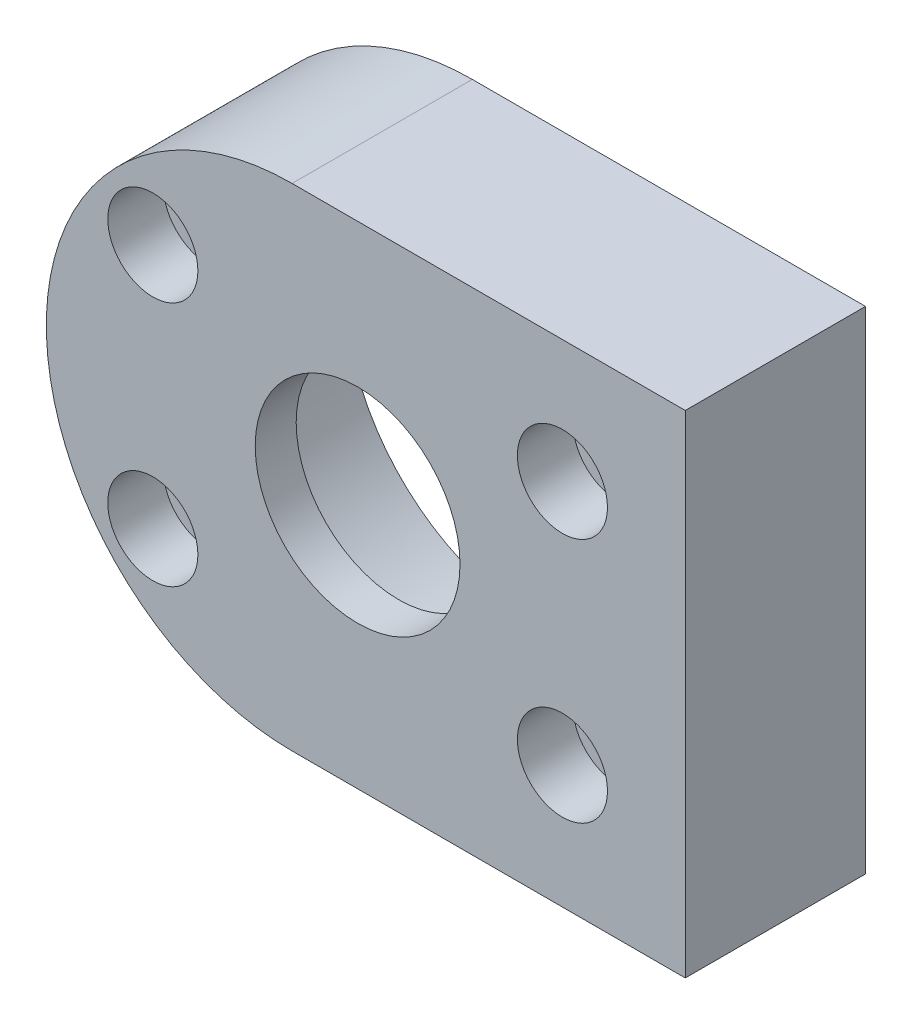
ISO-10303-21;
HEADER;
FILE_DESCRIPTION(('STEP AP214'),'2;1');
FILE_NAME('part.step','',(''),(''),'','','');
FILE_SCHEMA(('AUTOMOTIVE_DESIGN { 1 0 10303 214 1 1 1 1 }'));
ENDSEC;
DATA;
#1=APPLICATION_CONTEXT('core data for automotive mechanical design processes');
#2=APPLICATION_PROTOCOL_DEFINITION('international standard','automotive_design',2000,#1);
#3=PRODUCT_CONTEXT('',#1,'mechanical');
#4=PRODUCT('Part','Part','',(#3));
#5=PRODUCT_RELATED_PRODUCT_CATEGORY('part','',(#4));
#6=PRODUCT_DEFINITION_FORMATION('','',#4);
#7=PRODUCT_DEFINITION_CONTEXT('part definition',#1,'design');
#8=PRODUCT_DEFINITION('design','',#6,#7);
#9=PRODUCT_DEFINITION_SHAPE('','',#8);
#10=(LENGTH_UNIT() NAMED_UNIT(*) SI_UNIT(.MILLI.,.METRE.));
#11=(NAMED_UNIT(*) PLANE_ANGLE_UNIT() SI_UNIT($,.RADIAN.));
#12=(NAMED_UNIT(*) SI_UNIT($,.STERADIAN.) SOLID_ANGLE_UNIT());
#13=UNCERTAINTY_MEASURE_WITH_UNIT(LENGTH_MEASURE(1.E-05),#10,'distance_accuracy_value','');
#14=(GEOMETRIC_REPRESENTATION_CONTEXT(3) GLOBAL_UNCERTAINTY_ASSIGNED_CONTEXT((#13)) GLOBAL_UNIT_ASSIGNED_CONTEXT((#10,
#11,#12)) REPRESENTATION_CONTEXT('',''));
#15=CARTESIAN_POINT('',(0.,0.,0.));
#16=DIRECTION('',(0.,0.,1.));
#17=DIRECTION('',(1.,0.,0.));
#18=AXIS2_PLACEMENT_3D('',#15,#16,#17);
#19=CARTESIAN_POINT('',(0.,0.,22.));
#20=DIRECTION('',(0.,0.,-1.));
#21=DIRECTION('',(-1.,0.,0.));
#22=AXIS2_PLACEMENT_3D('',#19,#20,#21);
#23=CYLINDRICAL_SURFACE('',#22,12.5);
#24=CARTESIAN_POINT('',(0.,0.,22.));
#25=DIRECTION('',(0.,0.,1.));
#26=DIRECTION('',(1.,0.,0.));
#27=AXIS2_PLACEMENT_3D('',#24,#25,#26);
#28=CIRCLE('',#27,12.5);
#29=CARTESIAN_POINT('',(12.5,0.,22.));
#30=VERTEX_POINT('',#29);
#31=EDGE_CURVE('E115',#30,#30,#28,.T.);
#32=ORIENTED_EDGE('',*,*,#31,.T.);
#33=EDGE_LOOP('',(#32));
#34=FACE_BOUND('',#33,.T.);
#35=CARTESIAN_POINT('',(0.,0.,17.));
#36=DIRECTION('',(0.,0.,-1.));
#37=DIRECTION('',(-1.,0.,0.));
#38=AXIS2_PLACEMENT_3D('',#35,#36,#37);
#39=CIRCLE('',#38,12.5);
#40=CARTESIAN_POINT('',(-12.5,0.,17.));
#41=VERTEX_POINT('',#40);
#42=EDGE_CURVE('E43',#41,#41,#39,.T.);
#43=ORIENTED_EDGE('',*,*,#42,.T.);
#44=EDGE_LOOP('',(#43));
#45=FACE_BOUND('',#44,.T.);
#46=ADVANCED_FACE('F39',(#34,#45),#23,.F.);
#47=CARTESIAN_POINT('',(-8.,0.,22.));
#48=DIRECTION('',(0.,0.,1.));
#49=DIRECTION('',(1.,0.,0.));
#50=AXIS2_PLACEMENT_3D('',#47,#48,#49);
#51=PLANE('',#50);
#52=CARTESIAN_POINT('',(-25.,15.,22.));
#53=DIRECTION('',(0.,0.,1.));
#54=DIRECTION('',(1.,0.,0.));
#55=AXIS2_PLACEMENT_3D('',#52,#53,#54);
#56=CIRCLE('',#55,5.5);
#57=CARTESIAN_POINT('',(-19.5,15.,22.));
#58=VERTEX_POINT('',#57);
#59=EDGE_CURVE('E195',#58,#58,#56,.T.);
#60=ORIENTED_EDGE('',*,*,#59,.F.);
#61=EDGE_LOOP('',(#60));
#62=FACE_BOUND('',#61,.T.);
#63=CARTESIAN_POINT('',(-25.,-15.,22.));
#64=DIRECTION('',(0.,0.,1.));
#65=DIRECTION('',(1.,0.,0.));
#66=AXIS2_PLACEMENT_3D('',#63,#64,#65);
#67=CIRCLE('',#66,5.5);
#68=CARTESIAN_POINT('',(-19.5,-15.,22.));
#69=VERTEX_POINT('',#68);
#70=EDGE_CURVE('E179',#69,#69,#67,.T.);
#71=ORIENTED_EDGE('',*,*,#70,.F.);
#72=EDGE_LOOP('',(#71));
#73=FACE_BOUND('',#72,.T.);
#74=CARTESIAN_POINT('',(25.,15.,22.));
#75=DIRECTION('',(0.,0.,1.));
#76=DIRECTION('',(1.,0.,0.));
#77=AXIS2_PLACEMENT_3D('',#74,#75,#76);
#78=CIRCLE('',#77,5.5);
#79=CARTESIAN_POINT('',(30.5,15.,22.));
#80=VERTEX_POINT('',#79);
#81=EDGE_CURVE('E163',#80,#80,#78,.T.);
#82=ORIENTED_EDGE('',*,*,#81,.F.);
#83=EDGE_LOOP('',(#82));
#84=FACE_BOUND('',#83,.T.);
#85=CARTESIAN_POINT('',(25.,-15.,22.));
#86=DIRECTION('',(0.,0.,1.));
#87=DIRECTION('',(1.,0.,0.));
#88=AXIS2_PLACEMENT_3D('',#85,#86,#87);
#89=CIRCLE('',#88,5.5);
#90=CARTESIAN_POINT('',(30.5,-15.,22.));
#91=VERTEX_POINT('',#90);
#92=EDGE_CURVE('E147',#91,#91,#89,.T.);
#93=ORIENTED_EDGE('',*,*,#92,.F.);
#94=EDGE_LOOP('',(#93));
#95=FACE_BOUND('',#94,.T.);
#96=DIRECTION('',(0.,1.,0.));
#97=VECTOR('',#96,1.);
#98=CARTESIAN_POINT('',(40.,30.,22.));
#99=LINE('',#98,#97);
#100=CARTESIAN_POINT('',(40.,-30.,22.));
#101=VERTEX_POINT('',#100);
#102=CARTESIAN_POINT('',(40.,30.,22.));
#103=VERTEX_POINT('',#102);
#104=EDGE_CURVE('E94',#101,#103,#99,.T.);
#105=ORIENTED_EDGE('',*,*,#104,.T.);
#106=DIRECTION('',(-1.,0.,0.));
#107=VECTOR('',#106,1.);
#108=CARTESIAN_POINT('',(-8.,30.,22.));
#109=LINE('',#108,#107);
#110=CARTESIAN_POINT('',(-8.,30.,22.));
#111=VERTEX_POINT('',#110);
#112=EDGE_CURVE('E88',#103,#111,#109,.T.);
#113=ORIENTED_EDGE('',*,*,#112,.T.);
#114=CARTESIAN_POINT('',(-8.,0.,22.));
#115=DIRECTION('',(0.,0.,1.));
#116=DIRECTION('',(1.,0.,0.));
#117=AXIS2_PLACEMENT_3D('',#114,#115,#116);
#118=CIRCLE('',#117,30.);
#119=CARTESIAN_POINT('',(-8.,-30.,22.));
#120=VERTEX_POINT('',#119);
#121=EDGE_CURVE('E92',#111,#120,#118,.T.);
#122=ORIENTED_EDGE('',*,*,#121,.T.);
#123=DIRECTION('',(1.,0.,0.));
#124=VECTOR('',#123,1.);
#125=CARTESIAN_POINT('',(-8.,-30.,22.));
#126=LINE('',#125,#124);
#127=EDGE_CURVE('E58',#120,#101,#126,.T.);
#128=ORIENTED_EDGE('',*,*,#127,.T.);
#129=EDGE_LOOP('',(#105,#113,#122,#128));
#130=FACE_BOUND('',#129,.T.);
#131=ORIENTED_EDGE('',*,*,#31,.F.);
#132=EDGE_LOOP('',(#131));
#133=FACE_BOUND('',#132,.T.);
#134=ADVANCED_FACE('F89',(#62,#73,#84,#95,#130,#133),#51,.T.);
#135=CARTESIAN_POINT('',(-8.,0.,0.));
#136=DIRECTION('',(0.,0.,1.));
#137=DIRECTION('',(1.,0.,0.));
#138=AXIS2_PLACEMENT_3D('',#135,#136,#137);
#139=PLANE('',#138);
#140=CARTESIAN_POINT('',(0.,0.,0.));
#141=DIRECTION('',(0.,0.,-1.));
#142=DIRECTION('',(-1.,0.,0.));
#143=AXIS2_PLACEMENT_3D('',#140,#141,#142);
#144=CIRCLE('',#143,23.5);
#145=CARTESIAN_POINT('',(-23.5,0.,0.));
#146=VERTEX_POINT('',#145);
#147=EDGE_CURVE('E200',#146,#146,#144,.T.);
#148=ORIENTED_EDGE('',*,*,#147,.F.);
#149=EDGE_LOOP('',(#148));
#150=FACE_BOUND('',#149,.T.);
#151=CARTESIAN_POINT('',(-25.,15.,0.));
#152=DIRECTION('',(0.,0.,1.));
#153=DIRECTION('',(1.,0.,0.));
#154=AXIS2_PLACEMENT_3D('',#151,#152,#153);
#155=CIRCLE('',#154,3.29999999999999);
#156=CARTESIAN_POINT('',(-21.7,15.,0.));
#157=VERTEX_POINT('',#156);
#158=EDGE_CURVE('E183',#157,#157,#155,.T.);
#159=ORIENTED_EDGE('',*,*,#158,.T.);
#160=EDGE_LOOP('',(#159));
#161=FACE_BOUND('',#160,.T.);
#162=CARTESIAN_POINT('',(-25.,-15.,0.));
#163=DIRECTION('',(0.,0.,1.));
#164=DIRECTION('',(1.,0.,0.));
#165=AXIS2_PLACEMENT_3D('',#162,#163,#164);
#166=CIRCLE('',#165,3.29999999999999);
#167=CARTESIAN_POINT('',(-21.7,-15.,0.));
#168=VERTEX_POINT('',#167);
#169=EDGE_CURVE('E167',#168,#168,#166,.T.);
#170=ORIENTED_EDGE('',*,*,#169,.T.);
#171=EDGE_LOOP('',(#170));
#172=FACE_BOUND('',#171,.T.);
#173=CARTESIAN_POINT('',(25.,15.,0.));
#174=DIRECTION('',(0.,0.,1.));
#175=DIRECTION('',(1.,0.,0.));
#176=AXIS2_PLACEMENT_3D('',#173,#174,#175);
#177=CIRCLE('',#176,3.29999999999999);
#178=CARTESIAN_POINT('',(28.3,15.,0.));
#179=VERTEX_POINT('',#178);
#180=EDGE_CURVE('E151',#179,#179,#177,.T.);
#181=ORIENTED_EDGE('',*,*,#180,.T.);
#182=EDGE_LOOP('',(#181));
#183=FACE_BOUND('',#182,.T.);
#184=CARTESIAN_POINT('',(25.,-15.,0.));
#185=DIRECTION('',(0.,0.,1.));
#186=DIRECTION('',(1.,0.,0.));
#187=AXIS2_PLACEMENT_3D('',#184,#185,#186);
#188=CIRCLE('',#187,3.29999999999999);
#189=CARTESIAN_POINT('',(28.3,-15.,0.));
#190=VERTEX_POINT('',#189);
#191=EDGE_CURVE('E135',#190,#190,#188,.T.);
#192=ORIENTED_EDGE('',*,*,#191,.T.);
#193=EDGE_LOOP('',(#192));
#194=FACE_BOUND('',#193,.T.);
#195=DIRECTION('',(0.,1.,0.));
#196=VECTOR('',#195,1.);
#197=CARTESIAN_POINT('',(40.,30.,0.));
#198=LINE('',#197,#196);
#199=CARTESIAN_POINT('',(40.,-30.,0.));
#200=VERTEX_POINT('',#199);
#201=CARTESIAN_POINT('',(40.,30.,0.));
#202=VERTEX_POINT('',#201);
#203=EDGE_CURVE('E111',#200,#202,#198,.T.);
#204=ORIENTED_EDGE('',*,*,#203,.F.);
#205=DIRECTION('',(1.,0.,0.));
#206=VECTOR('',#205,1.);
#207=CARTESIAN_POINT('',(-8.,-30.,0.));
#208=LINE('',#207,#206);
#209=CARTESIAN_POINT('',(-8.,-30.,0.));
#210=VERTEX_POINT('',#209);
#211=EDGE_CURVE('E81',#210,#200,#208,.T.);
#212=ORIENTED_EDGE('',*,*,#211,.F.);
#213=CARTESIAN_POINT('',(-8.,0.,0.));
#214=DIRECTION('',(0.,0.,1.));
#215=DIRECTION('',(1.,0.,0.));
#216=AXIS2_PLACEMENT_3D('',#213,#214,#215);
#217=CIRCLE('',#216,30.);
#218=CARTESIAN_POINT('',(-8.,30.,0.));
#219=VERTEX_POINT('',#218);
#220=EDGE_CURVE('E75',#219,#210,#217,.T.);
#221=ORIENTED_EDGE('',*,*,#220,.F.);
#222=DIRECTION('',(-1.,0.,0.));
#223=VECTOR('',#222,1.);
#224=CARTESIAN_POINT('',(-8.,30.,0.));
#225=LINE('',#224,#223);
#226=EDGE_CURVE('E99',#202,#219,#225,.T.);
#227=ORIENTED_EDGE('',*,*,#226,.F.);
#228=EDGE_LOOP('',(#204,#212,#221,#227));
#229=FACE_BOUND('',#228,.T.);
#230=ADVANCED_FACE('F128',(#150,#161,#172,#183,#194,#229),#139,.F.);
#231=CARTESIAN_POINT('',(40.,30.,22.));
#232=DIRECTION('',(-1.,0.,0.));
#233=DIRECTION('',(0.,-1.,0.));
#234=AXIS2_PLACEMENT_3D('',#231,#232,#233);
#235=PLANE('',#234);
#236=ORIENTED_EDGE('',*,*,#203,.T.);
#237=DIRECTION('',(0.,0.,-1.));
#238=VECTOR('',#237,1.);
#239=CARTESIAN_POINT('',(40.,30.,22.));
#240=LINE('',#239,#238);
#241=EDGE_CURVE('E11',#103,#202,#240,.T.);
#242=ORIENTED_EDGE('',*,*,#241,.F.);
#243=ORIENTED_EDGE('',*,*,#104,.F.);
#244=DIRECTION('',(0.,0.,-1.));
#245=VECTOR('',#244,1.);
#246=CARTESIAN_POINT('',(40.,-30.,22.));
#247=LINE('',#246,#245);
#248=EDGE_CURVE('E107',#101,#200,#247,.T.);
#249=ORIENTED_EDGE('',*,*,#248,.T.);
#250=EDGE_LOOP('',(#236,#242,#243,#249));
#251=FACE_BOUND('',#250,.T.);
#252=ADVANCED_FACE('F41',(#251),#235,.F.);
#253=CARTESIAN_POINT('',(-8.,30.,22.));
#254=DIRECTION('',(0.,-1.,0.));
#255=DIRECTION('',(0.,0.,-1.));
#256=AXIS2_PLACEMENT_3D('',#253,#254,#255);
#257=PLANE('',#256);
#258=ORIENTED_EDGE('',*,*,#226,.T.);
#259=DIRECTION('',(0.,0.,-1.));
#260=VECTOR('',#259,1.);
#261=CARTESIAN_POINT('',(-8.,30.,22.));
#262=LINE('',#261,#260);
#263=EDGE_CURVE('E50',#111,#219,#262,.T.);
#264=ORIENTED_EDGE('',*,*,#263,.F.);
#265=ORIENTED_EDGE('',*,*,#112,.F.);
#266=ORIENTED_EDGE('',*,*,#241,.T.);
#267=EDGE_LOOP('',(#258,#264,#265,#266));
#268=FACE_BOUND('',#267,.T.);
#269=ADVANCED_FACE('F98',(#268),#257,.F.);
#270=CARTESIAN_POINT('',(-8.,0.,22.));
#271=DIRECTION('',(0.,0.,-1.));
#272=DIRECTION('',(-1.,0.,0.));
#273=AXIS2_PLACEMENT_3D('',#270,#271,#272);
#274=CYLINDRICAL_SURFACE('',#273,30.);
#275=ORIENTED_EDGE('',*,*,#220,.T.);
#276=DIRECTION('',(0.,0.,-1.));
#277=VECTOR('',#276,1.);
#278=CARTESIAN_POINT('',(-8.,-30.,22.));
#279=LINE('',#278,#277);
#280=EDGE_CURVE('E101',#120,#210,#279,.T.);
#281=ORIENTED_EDGE('',*,*,#280,.F.);
#282=ORIENTED_EDGE('',*,*,#121,.F.);
#283=ORIENTED_EDGE('',*,*,#263,.T.);
#284=EDGE_LOOP('',(#275,#281,#282,#283));
#285=FACE_BOUND('',#284,.T.);
#286=ADVANCED_FACE('F103',(#285),#274,.T.);
#287=CARTESIAN_POINT('',(-8.,-30.,22.));
#288=DIRECTION('',(0.,1.,0.));
#289=DIRECTION('',(-1.,0.,0.));
#290=AXIS2_PLACEMENT_3D('',#287,#288,#289);
#291=PLANE('',#290);
#292=ORIENTED_EDGE('',*,*,#211,.T.);
#293=ORIENTED_EDGE('',*,*,#248,.F.);
#294=ORIENTED_EDGE('',*,*,#127,.F.);
#295=ORIENTED_EDGE('',*,*,#280,.T.);
#296=EDGE_LOOP('',(#292,#293,#294,#295));
#297=FACE_BOUND('',#296,.T.);
#298=ADVANCED_FACE('F125',(#297),#291,.F.);
#299=CARTESIAN_POINT('',(25.,-15.,22.));
#300=DIRECTION('',(0.,0.,1.));
#301=DIRECTION('',(1.,0.,0.));
#302=AXIS2_PLACEMENT_3D('',#299,#300,#301);
#303=CYLINDRICAL_SURFACE('',#302,3.3);
#304=ORIENTED_EDGE('',*,*,#191,.F.);
#305=EDGE_LOOP('',(#304));
#306=FACE_BOUND('',#305,.T.);
#307=CARTESIAN_POINT('',(25.,-15.,15.2));
#308=DIRECTION('',(0.,0.,1.));
#309=DIRECTION('',(1.,0.,0.));
#310=AXIS2_PLACEMENT_3D('',#307,#308,#309);
#311=CIRCLE('',#310,3.3);
#312=CARTESIAN_POINT('',(28.3,-15.,15.2));
#313=VERTEX_POINT('',#312);
#314=EDGE_CURVE('E139',#313,#313,#311,.T.);
#315=ORIENTED_EDGE('',*,*,#314,.T.);
#316=EDGE_LOOP('',(#315));
#317=FACE_BOUND('',#316,.T.);
#318=ADVANCED_FACE('F240',(#306,#317),#303,.F.);
#319=CARTESIAN_POINT('',(28.3,-15.,15.2));
#320=DIRECTION('',(0.,0.,-1.));
#321=DIRECTION('',(-1.,0.,0.));
#322=AXIS2_PLACEMENT_3D('',#319,#320,#321);
#323=PLANE('',#322);
#324=ORIENTED_EDGE('',*,*,#314,.F.);
#325=EDGE_LOOP('',(#324));
#326=FACE_BOUND('',#325,.T.);
#327=CARTESIAN_POINT('',(25.,-15.,15.2));
#328=DIRECTION('',(0.,0.,1.));
#329=DIRECTION('',(1.,0.,0.));
#330=AXIS2_PLACEMENT_3D('',#327,#328,#329);
#331=CIRCLE('',#330,5.5);
#332=CARTESIAN_POINT('',(30.5,-15.,15.2));
#333=VERTEX_POINT('',#332);
#334=EDGE_CURVE('E143',#333,#333,#331,.T.);
#335=ORIENTED_EDGE('',*,*,#334,.T.);
#336=EDGE_LOOP('',(#335));
#337=FACE_BOUND('',#336,.T.);
#338=ADVANCED_FACE('F278',(#326,#337),#323,.F.);
#339=CARTESIAN_POINT('',(25.,-15.,22.));
#340=DIRECTION('',(0.,0.,1.));
#341=DIRECTION('',(1.,0.,0.));
#342=AXIS2_PLACEMENT_3D('',#339,#340,#341);
#343=CYLINDRICAL_SURFACE('',#342,5.5);
#344=ORIENTED_EDGE('',*,*,#334,.F.);
#345=EDGE_LOOP('',(#344));
#346=FACE_BOUND('',#345,.T.);
#347=ORIENTED_EDGE('',*,*,#92,.T.);
#348=EDGE_LOOP('',(#347));
#349=FACE_BOUND('',#348,.T.);
#350=ADVANCED_FACE('F287',(#346,#349),#343,.F.);
#351=CARTESIAN_POINT('',(25.,15.,22.));
#352=DIRECTION('',(0.,0.,1.));
#353=DIRECTION('',(1.,0.,0.));
#354=AXIS2_PLACEMENT_3D('',#351,#352,#353);
#355=CYLINDRICAL_SURFACE('',#354,3.3);
#356=ORIENTED_EDGE('',*,*,#180,.F.);
#357=EDGE_LOOP('',(#356));
#358=FACE_BOUND('',#357,.T.);
#359=CARTESIAN_POINT('',(25.,15.,15.2));
#360=DIRECTION('',(0.,0.,1.));
#361=DIRECTION('',(1.,0.,0.));
#362=AXIS2_PLACEMENT_3D('',#359,#360,#361);
#363=CIRCLE('',#362,3.3);
#364=CARTESIAN_POINT('',(28.3,15.,15.2));
#365=VERTEX_POINT('',#364);
#366=EDGE_CURVE('E155',#365,#365,#363,.T.);
#367=ORIENTED_EDGE('',*,*,#366,.T.);
#368=EDGE_LOOP('',(#367));
#369=FACE_BOUND('',#368,.T.);
#370=ADVANCED_FACE('F296',(#358,#369),#355,.F.);
#371=CARTESIAN_POINT('',(28.3,15.,15.2));
#372=DIRECTION('',(0.,0.,-1.));
#373=DIRECTION('',(-1.,0.,0.));
#374=AXIS2_PLACEMENT_3D('',#371,#372,#373);
#375=PLANE('',#374);
#376=ORIENTED_EDGE('',*,*,#366,.F.);
#377=EDGE_LOOP('',(#376));
#378=FACE_BOUND('',#377,.T.);
#379=CARTESIAN_POINT('',(25.,15.,15.2));
#380=DIRECTION('',(0.,0.,1.));
#381=DIRECTION('',(1.,0.,0.));
#382=AXIS2_PLACEMENT_3D('',#379,#380,#381);
#383=CIRCLE('',#382,5.5);
#384=CARTESIAN_POINT('',(30.5,15.,15.2));
#385=VERTEX_POINT('',#384);
#386=EDGE_CURVE('E159',#385,#385,#383,.T.);
#387=ORIENTED_EDGE('',*,*,#386,.T.);
#388=EDGE_LOOP('',(#387));
#389=FACE_BOUND('',#388,.T.);
#390=ADVANCED_FACE('F306',(#378,#389),#375,.F.);
#391=CARTESIAN_POINT('',(25.,15.,22.));
#392=DIRECTION('',(0.,0.,1.));
#393=DIRECTION('',(1.,0.,0.));
#394=AXIS2_PLACEMENT_3D('',#391,#392,#393);
#395=CYLINDRICAL_SURFACE('',#394,5.5);
#396=ORIENTED_EDGE('',*,*,#386,.F.);
#397=EDGE_LOOP('',(#396));
#398=FACE_BOUND('',#397,.T.);
#399=ORIENTED_EDGE('',*,*,#81,.T.);
#400=EDGE_LOOP('',(#399));
#401=FACE_BOUND('',#400,.T.);
#402=ADVANCED_FACE('F316',(#398,#401),#395,.F.);
#403=CARTESIAN_POINT('',(-25.,-15.,22.));
#404=DIRECTION('',(0.,0.,1.));
#405=DIRECTION('',(1.,0.,0.));
#406=AXIS2_PLACEMENT_3D('',#403,#404,#405);
#407=CYLINDRICAL_SURFACE('',#406,3.3);
#408=ORIENTED_EDGE('',*,*,#169,.F.);
#409=EDGE_LOOP('',(#408));
#410=FACE_BOUND('',#409,.T.);
#411=CARTESIAN_POINT('',(-25.,-15.,15.2));
#412=DIRECTION('',(0.,0.,1.));
#413=DIRECTION('',(1.,0.,0.));
#414=AXIS2_PLACEMENT_3D('',#411,#412,#413);
#415=CIRCLE('',#414,3.3);
#416=CARTESIAN_POINT('',(-21.7,-15.,15.2));
#417=VERTEX_POINT('',#416);
#418=EDGE_CURVE('E171',#417,#417,#415,.T.);
#419=ORIENTED_EDGE('',*,*,#418,.T.);
#420=EDGE_LOOP('',(#419));
#421=FACE_BOUND('',#420,.T.);
#422=ADVANCED_FACE('F326',(#410,#421),#407,.F.);
#423=CARTESIAN_POINT('',(-21.7,-15.,15.2));
#424=DIRECTION('',(0.,0.,-1.));
#425=DIRECTION('',(-1.,0.,0.));
#426=AXIS2_PLACEMENT_3D('',#423,#424,#425);
#427=PLANE('',#426);
#428=ORIENTED_EDGE('',*,*,#418,.F.);
#429=EDGE_LOOP('',(#428));
#430=FACE_BOUND('',#429,.T.);
#431=CARTESIAN_POINT('',(-25.,-15.,15.2));
#432=DIRECTION('',(0.,0.,1.));
#433=DIRECTION('',(1.,0.,0.));
#434=AXIS2_PLACEMENT_3D('',#431,#432,#433);
#435=CIRCLE('',#434,5.5);
#436=CARTESIAN_POINT('',(-19.5,-15.,15.2));
#437=VERTEX_POINT('',#436);
#438=EDGE_CURVE('E175',#437,#437,#435,.T.);
#439=ORIENTED_EDGE('',*,*,#438,.T.);
#440=EDGE_LOOP('',(#439));
#441=FACE_BOUND('',#440,.T.);
#442=ADVANCED_FACE('F336',(#430,#441),#427,.F.);
#443=CARTESIAN_POINT('',(-25.,-15.,22.));
#444=DIRECTION('',(0.,0.,1.));
#445=DIRECTION('',(1.,0.,0.));
#446=AXIS2_PLACEMENT_3D('',#443,#444,#445);
#447=CYLINDRICAL_SURFACE('',#446,5.5);
#448=ORIENTED_EDGE('',*,*,#438,.F.);
#449=EDGE_LOOP('',(#448));
#450=FACE_BOUND('',#449,.T.);
#451=ORIENTED_EDGE('',*,*,#70,.T.);
#452=EDGE_LOOP('',(#451));
#453=FACE_BOUND('',#452,.T.);
#454=ADVANCED_FACE('F346',(#450,#453),#447,.F.);
#455=CARTESIAN_POINT('',(-25.,15.,22.));
#456=DIRECTION('',(0.,0.,1.));
#457=DIRECTION('',(1.,0.,0.));
#458=AXIS2_PLACEMENT_3D('',#455,#456,#457);
#459=CYLINDRICAL_SURFACE('',#458,3.3);
#460=ORIENTED_EDGE('',*,*,#158,.F.);
#461=EDGE_LOOP('',(#460));
#462=FACE_BOUND('',#461,.T.);
#463=CARTESIAN_POINT('',(-25.,15.,15.2));
#464=DIRECTION('',(0.,0.,1.));
#465=DIRECTION('',(1.,0.,0.));
#466=AXIS2_PLACEMENT_3D('',#463,#464,#465);
#467=CIRCLE('',#466,3.3);
#468=CARTESIAN_POINT('',(-21.7,15.,15.2));
#469=VERTEX_POINT('',#468);
#470=EDGE_CURVE('E187',#469,#469,#467,.T.);
#471=ORIENTED_EDGE('',*,*,#470,.T.);
#472=EDGE_LOOP('',(#471));
#473=FACE_BOUND('',#472,.T.);
#474=ADVANCED_FACE('F356',(#462,#473),#459,.F.);
#475=CARTESIAN_POINT('',(-21.7,15.,15.2));
#476=DIRECTION('',(0.,0.,-1.));
#477=DIRECTION('',(-1.,0.,0.));
#478=AXIS2_PLACEMENT_3D('',#475,#476,#477);
#479=PLANE('',#478);
#480=ORIENTED_EDGE('',*,*,#470,.F.);
#481=EDGE_LOOP('',(#480));
#482=FACE_BOUND('',#481,.T.);
#483=CARTESIAN_POINT('',(-25.,15.,15.2));
#484=DIRECTION('',(0.,0.,1.));
#485=DIRECTION('',(1.,0.,0.));
#486=AXIS2_PLACEMENT_3D('',#483,#484,#485);
#487=CIRCLE('',#486,5.5);
#488=CARTESIAN_POINT('',(-19.5,15.,15.2));
#489=VERTEX_POINT('',#488);
#490=EDGE_CURVE('E191',#489,#489,#487,.T.);
#491=ORIENTED_EDGE('',*,*,#490,.T.);
#492=EDGE_LOOP('',(#491));
#493=FACE_BOUND('',#492,.T.);
#494=ADVANCED_FACE('F366',(#482,#493),#479,.F.);
#495=CARTESIAN_POINT('',(-25.,15.,22.));
#496=DIRECTION('',(0.,0.,1.));
#497=DIRECTION('',(1.,0.,0.));
#498=AXIS2_PLACEMENT_3D('',#495,#496,#497);
#499=CYLINDRICAL_SURFACE('',#498,5.5);
#500=ORIENTED_EDGE('',*,*,#490,.F.);
#501=EDGE_LOOP('',(#500));
#502=FACE_BOUND('',#501,.T.);
#503=ORIENTED_EDGE('',*,*,#59,.T.);
#504=EDGE_LOOP('',(#503));
#505=FACE_BOUND('',#504,.T.);
#506=ADVANCED_FACE('F375',(#502,#505),#499,.F.);
#507=CARTESIAN_POINT('',(0.,0.,13.));
#508=DIRECTION('',(0.,0.,-1.));
#509=DIRECTION('',(-1.,0.,0.));
#510=AXIS2_PLACEMENT_3D('',#507,#508,#509);
#511=CYLINDRICAL_SURFACE('',#510,23.5);
#512=CARTESIAN_POINT('',(0.,0.,13.));
#513=DIRECTION('',(0.,0.,-1.));
#514=DIRECTION('',(-1.,0.,0.));
#515=AXIS2_PLACEMENT_3D('',#512,#513,#514);
#516=CIRCLE('',#515,23.5);
#517=CARTESIAN_POINT('',(-23.5,0.,13.));
#518=VERTEX_POINT('',#517);
#519=EDGE_CURVE('E199',#518,#518,#516,.T.);
#520=ORIENTED_EDGE('',*,*,#519,.F.);
#521=EDGE_LOOP('',(#520));
#522=FACE_BOUND('',#521,.T.);
#523=ORIENTED_EDGE('',*,*,#147,.T.);
#524=EDGE_LOOP('',(#523));
#525=FACE_BOUND('',#524,.T.);
#526=ADVANCED_FACE('F384',(#522,#525),#511,.F.);
#527=CARTESIAN_POINT('',(0.,0.,13.));
#528=DIRECTION('',(0.,0.,-1.));
#529=DIRECTION('',(-1.,0.,0.));
#530=AXIS2_PLACEMENT_3D('',#527,#528,#529);
#531=PLANE('',#530);
#532=CARTESIAN_POINT('',(0.,0.,13.));
#533=DIRECTION('',(0.,0.,-1.));
#534=DIRECTION('',(-1.,0.,0.));
#535=AXIS2_PLACEMENT_3D('',#532,#533,#534);
#536=CIRCLE('',#535,20.);
#537=CARTESIAN_POINT('',(-20.,0.,13.));
#538=VERTEX_POINT('',#537);
#539=EDGE_CURVE('E207',#538,#538,#536,.T.);
#540=ORIENTED_EDGE('',*,*,#539,.F.);
#541=EDGE_LOOP('',(#540));
#542=FACE_BOUND('',#541,.T.);
#543=ORIENTED_EDGE('',*,*,#519,.T.);
#544=EDGE_LOOP('',(#543));
#545=FACE_BOUND('',#544,.T.);
#546=ADVANCED_FACE('F228',(#542,#545),#531,.T.);
#547=CARTESIAN_POINT('',(0.,0.,17.));
#548=DIRECTION('',(0.,0.,-1.));
#549=DIRECTION('',(-1.,0.,0.));
#550=AXIS2_PLACEMENT_3D('',#547,#548,#549);
#551=CYLINDRICAL_SURFACE('',#550,20.);
#552=CARTESIAN_POINT('',(0.,0.,17.));
#553=DIRECTION('',(0.,0.,-1.));
#554=DIRECTION('',(-1.,0.,0.));
#555=AXIS2_PLACEMENT_3D('',#552,#553,#554);
#556=CIRCLE('',#555,20.);
#557=CARTESIAN_POINT('',(-20.,0.,17.));
#558=VERTEX_POINT('',#557);
#559=EDGE_CURVE('E211',#558,#558,#556,.T.);
#560=ORIENTED_EDGE('',*,*,#559,.F.);
#561=EDGE_LOOP('',(#560));
#562=FACE_BOUND('',#561,.T.);
#563=ORIENTED_EDGE('',*,*,#539,.T.);
#564=EDGE_LOOP('',(#563));
#565=FACE_BOUND('',#564,.T.);
#566=ADVANCED_FACE('F223',(#562,#565),#551,.F.);
#567=CARTESIAN_POINT('',(0.,0.,17.));
#568=DIRECTION('',(0.,0.,-1.));
#569=DIRECTION('',(-1.,0.,0.));
#570=AXIS2_PLACEMENT_3D('',#567,#568,#569);
#571=PLANE('',#570);
#572=ORIENTED_EDGE('',*,*,#42,.F.);
#573=EDGE_LOOP('',(#572));
#574=FACE_BOUND('',#573,.T.);
#575=ORIENTED_EDGE('',*,*,#559,.T.);
#576=EDGE_LOOP('',(#575));
#577=FACE_BOUND('',#576,.T.);
#578=ADVANCED_FACE('F221',(#574,#577),#571,.T.);
#579=CLOSED_SHELL('',(#46,#134,#230,#252,#269,#286,#298,#318,#338,#350,#370,#390,#402,#422,#442,
#454,#474,#494,#506,#526,#546,#566,#578));
#580=MANIFOLD_SOLID_BREP('B2',#579);
#581=ADVANCED_BREP_SHAPE_REPRESENTATION('',(#18,#580),#14);
#582=SHAPE_DEFINITION_REPRESENTATION(#9,#581);
ENDSEC;
END-ISO-10303-21;
